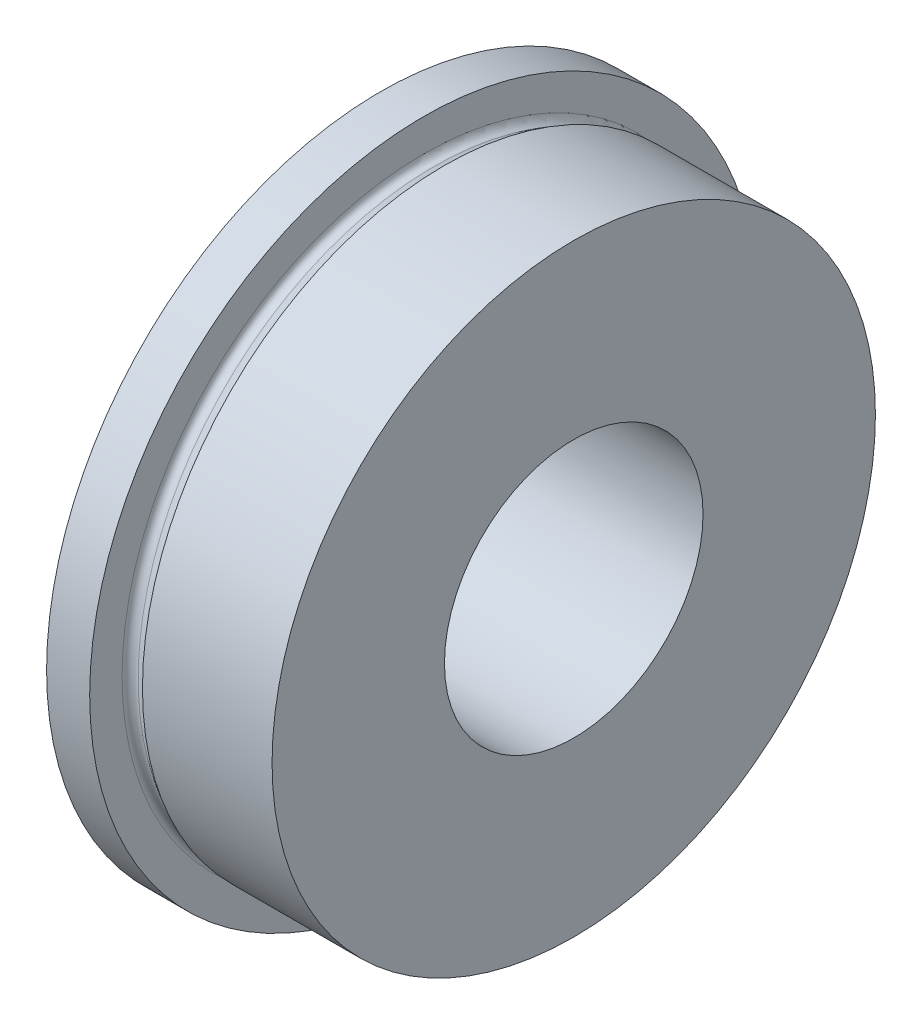
ISO-10303-21;
HEADER;
FILE_DESCRIPTION(('STEP AP214'),'2;1');
FILE_NAME('part.step','',(''),(''),'','','');
FILE_SCHEMA(('AUTOMOTIVE_DESIGN { 1 0 10303 214 1 1 1 1 }'));
ENDSEC;
DATA;
#1=APPLICATION_CONTEXT('core data for automotive mechanical design processes');
#2=APPLICATION_PROTOCOL_DEFINITION('international standard','automotive_design',2000,#1);
#3=PRODUCT_CONTEXT('',#1,'mechanical');
#4=PRODUCT('Part','Part','',(#3));
#5=PRODUCT_RELATED_PRODUCT_CATEGORY('part','',(#4));
#6=PRODUCT_DEFINITION_FORMATION('','',#4);
#7=PRODUCT_DEFINITION_CONTEXT('part definition',#1,'design');
#8=PRODUCT_DEFINITION('design','',#6,#7);
#9=PRODUCT_DEFINITION_SHAPE('','',#8);
#10=(LENGTH_UNIT() NAMED_UNIT(*) SI_UNIT(.MILLI.,.METRE.));
#11=(NAMED_UNIT(*) PLANE_ANGLE_UNIT() SI_UNIT($,.RADIAN.));
#12=(NAMED_UNIT(*) SI_UNIT($,.STERADIAN.) SOLID_ANGLE_UNIT());
#13=UNCERTAINTY_MEASURE_WITH_UNIT(LENGTH_MEASURE(1.E-05),#10,'distance_accuracy_value','');
#14=(GEOMETRIC_REPRESENTATION_CONTEXT(3) GLOBAL_UNCERTAINTY_ASSIGNED_CONTEXT((#13)) GLOBAL_UNIT_ASSIGNED_CONTEXT((#10,
#11,#12)) REPRESENTATION_CONTEXT('',''));
#15=CARTESIAN_POINT('',(0.,0.,0.));
#16=DIRECTION('',(0.,0.,1.));
#17=DIRECTION('',(1.,0.,0.));
#18=AXIS2_PLACEMENT_3D('',#15,#16,#17);
#19=CARTESIAN_POINT('',(0.,0.,0.));
#20=DIRECTION('',(-1.,0.,0.));
#21=DIRECTION('',(0.,0.,1.));
#22=AXIS2_PLACEMENT_3D('',#19,#20,#21);
#23=CYLINDRICAL_SURFACE('',#22,12.3063);
#24=CARTESIAN_POINT('',(0.,0.,0.));
#25=DIRECTION('',(-1.,0.,0.));
#26=DIRECTION('',(0.,0.,1.));
#27=AXIS2_PLACEMENT_3D('',#24,#25,#26);
#28=CIRCLE('',#27,12.3063);
#29=CARTESIAN_POINT('',(0.,0.,12.3063));
#30=VERTEX_POINT('',#29);
#31=EDGE_CURVE('E96',#30,#30,#28,.F.);
#32=ORIENTED_EDGE('',*,*,#31,.T.);
#33=EDGE_LOOP('',(#32));
#34=FACE_BOUND('',#33,.T.);
#35=CARTESIAN_POINT('',(1.58750000037,0.,0.));
#36=DIRECTION('',(-1.,0.,0.));
#37=DIRECTION('',(0.,0.,1.));
#38=AXIS2_PLACEMENT_3D('',#35,#36,#37);
#39=CIRCLE('',#38,12.3063);
#40=CARTESIAN_POINT('',(1.58750000037,0.,12.3063));
#41=VERTEX_POINT('',#40);
#42=EDGE_CURVE('E94',#41,#41,#39,.T.);
#43=ORIENTED_EDGE('',*,*,#42,.T.);
#44=EDGE_LOOP('',(#43));
#45=FACE_BOUND('',#44,.T.);
#46=ADVANCED_FACE('F17',(#34,#45),#23,.T.);
#47=CARTESIAN_POINT('',(0.,12.3063,0.));
#48=DIRECTION('',(1.,0.,0.));
#49=DIRECTION('',(0.,0.,-1.));
#50=AXIS2_PLACEMENT_3D('',#47,#48,#49);
#51=PLANE('',#50);
#52=CARTESIAN_POINT('',(0.,0.,0.));
#53=DIRECTION('',(-1.,0.,0.));
#54=DIRECTION('',(0.,0.,1.));
#55=AXIS2_PLACEMENT_3D('',#52,#53,#54);
#56=CIRCLE('',#55,9.906);
#57=CARTESIAN_POINT('',(0.,0.,9.906));
#58=VERTEX_POINT('',#57);
#59=EDGE_CURVE('E48',#58,#58,#56,.F.);
#60=ORIENTED_EDGE('',*,*,#59,.T.);
#61=EDGE_LOOP('',(#60));
#62=FACE_BOUND('',#61,.T.);
#63=ORIENTED_EDGE('',*,*,#31,.F.);
#64=EDGE_LOOP('',(#63));
#65=FACE_BOUND('',#64,.T.);
#66=ADVANCED_FACE('F66',(#62,#65),#51,.F.);
#67=CARTESIAN_POINT('',(1.5875,11.1125,0.));
#68=DIRECTION('',(-1.,0.,0.));
#69=DIRECTION('',(0.,0.,1.));
#70=AXIS2_PLACEMENT_3D('',#67,#68,#69);
#71=PLANE('',#70);
#72=CARTESIAN_POINT('',(1.5875,0.,0.));
#73=DIRECTION('',(1.,0.,0.));
#74=DIRECTION('',(0.,0.,1.));
#75=AXIS2_PLACEMENT_3D('',#72,#73,#74);
#76=CIRCLE('',#75,11.1125);
#77=CARTESIAN_POINT('',(1.5875,0.,-11.1125));
#78=VERTEX_POINT('',#77);
#79=CARTESIAN_POINT('',(1.5875,0.,11.1125));
#80=VERTEX_POINT('',#79);
#81=EDGE_CURVE('E34',#78,#80,#76,.F.);
#82=ORIENTED_EDGE('',*,*,#81,.T.);
#83=CARTESIAN_POINT('',(1.5875,0.,0.));
#84=DIRECTION('',(1.,0.,0.));
#85=DIRECTION('',(0.,0.,-1.));
#86=AXIS2_PLACEMENT_3D('',#83,#84,#85);
#87=CIRCLE('',#86,11.1125);
#88=EDGE_CURVE('E36',#80,#78,#87,.F.);
#89=ORIENTED_EDGE('',*,*,#88,.T.);
#90=EDGE_LOOP('',(#82,#89));
#91=FACE_BOUND('',#90,.T.);
#92=ORIENTED_EDGE('',*,*,#42,.F.);
#93=EDGE_LOOP('',(#92));
#94=FACE_BOUND('',#93,.T.);
#95=ADVANCED_FACE('F46',(#91,#94),#71,.F.);
#96=CARTESIAN_POINT('',(0.,0.,0.));
#97=DIRECTION('',(-1.,0.,0.));
#98=DIRECTION('',(0.,0.,1.));
#99=AXIS2_PLACEMENT_3D('',#96,#97,#98);
#100=CYLINDRICAL_SURFACE('',#99,9.906);
#101=CARTESIAN_POINT('',(0.380999999121,0.,0.));
#102=DIRECTION('',(-1.,0.,0.));
#103=DIRECTION('',(0.,0.,1.));
#104=AXIS2_PLACEMENT_3D('',#101,#102,#103);
#105=CIRCLE('',#104,9.906);
#106=CARTESIAN_POINT('',(0.380999999121,0.,9.906));
#107=VERTEX_POINT('',#106);
#108=EDGE_CURVE('E42',#107,#107,#105,.F.);
#109=ORIENTED_EDGE('',*,*,#108,.T.);
#110=EDGE_LOOP('',(#109));
#111=FACE_BOUND('',#110,.T.);
#112=ORIENTED_EDGE('',*,*,#59,.F.);
#113=EDGE_LOOP('',(#112));
#114=FACE_BOUND('',#113,.T.);
#115=ADVANCED_FACE('F65',(#111,#114),#100,.F.);
#116=CARTESIAN_POINT('',(0.381,9.906,0.));
#117=DIRECTION('',(1.,0.,0.));
#118=DIRECTION('',(0.,0.,-1.));
#119=AXIS2_PLACEMENT_3D('',#116,#117,#118);
#120=PLANE('',#119);
#121=CARTESIAN_POINT('',(0.380999999121,0.,0.));
#122=DIRECTION('',(-1.,0.,0.));
#123=DIRECTION('',(0.,0.,1.));
#124=AXIS2_PLACEMENT_3D('',#121,#122,#123);
#125=CIRCLE('',#124,6.35);
#126=CARTESIAN_POINT('',(0.380999999121,0.,6.35));
#127=VERTEX_POINT('',#126);
#128=EDGE_CURVE('E87',#127,#127,#125,.T.);
#129=ORIENTED_EDGE('',*,*,#128,.F.);
#130=EDGE_LOOP('',(#129));
#131=FACE_BOUND('',#130,.T.);
#132=ORIENTED_EDGE('',*,*,#108,.F.);
#133=EDGE_LOOP('',(#132));
#134=FACE_BOUND('',#133,.T.);
#135=ADVANCED_FACE('F138',(#131,#134),#120,.F.);
#136=CARTESIAN_POINT('',(1.8375,0.,0.));
#137=DIRECTION('',(-1.,0.,0.));
#138=DIRECTION('',(0.,0.,1.));
#139=AXIS2_PLACEMENT_3D('',#136,#137,#138);
#140=TOROIDAL_SURFACE('',#139,11.1125,0.25);
#141=ORIENTED_EDGE('',*,*,#88,.F.);
#142=ORIENTED_EDGE('',*,*,#81,.F.);
#143=EDGE_LOOP('',(#141,#142));
#144=FACE_BOUND('',#143,.T.);
#145=CARTESIAN_POINT('',(1.9625000000199,0.,0.));
#146=DIRECTION('',(1.,0.,0.));
#147=DIRECTION('',(0.,0.,-1.));
#148=AXIS2_PLACEMENT_3D('',#145,#146,#147);
#149=CIRCLE('',#148,10.8959936490655);
#150=CARTESIAN_POINT('',(1.9625000000199,0.,-10.8959936490655));
#151=VERTEX_POINT('',#150);
#152=EDGE_CURVE('E86',#151,#151,#149,.T.);
#153=ORIENTED_EDGE('',*,*,#152,.F.);
#154=EDGE_LOOP('',(#153));
#155=FACE_BOUND('',#154,.T.);
#156=ADVANCED_FACE('F38',(#144,#155),#140,.F.);
#157=CARTESIAN_POINT('',(0.,0.,0.));
#158=DIRECTION('',(-1.,0.,0.));
#159=DIRECTION('',(0.,0.,1.));
#160=AXIS2_PLACEMENT_3D('',#157,#158,#159);
#161=CYLINDRICAL_SURFACE('',#160,6.35);
#162=CARTESIAN_POINT('',(0.,0.,0.));
#163=DIRECTION('',(-1.,0.,0.));
#164=DIRECTION('',(0.,0.,1.));
#165=AXIS2_PLACEMENT_3D('',#162,#163,#164);
#166=CIRCLE('',#165,6.35);
#167=CARTESIAN_POINT('',(0.,0.,6.35));
#168=VERTEX_POINT('',#167);
#169=EDGE_CURVE('E83',#168,#168,#166,.F.);
#170=ORIENTED_EDGE('',*,*,#169,.T.);
#171=EDGE_LOOP('',(#170));
#172=FACE_BOUND('',#171,.T.);
#173=ORIENTED_EDGE('',*,*,#128,.T.);
#174=EDGE_LOOP('',(#173));
#175=FACE_BOUND('',#174,.T.);
#176=ADVANCED_FACE('F132',(#172,#175),#161,.T.);
#177=CARTESIAN_POINT('',(2.3375,0.,0.));
#178=DIRECTION('',(1.,0.,0.));
#179=DIRECTION('',(0.,0.,-1.));
#180=AXIS2_PLACEMENT_3D('',#177,#178,#179);
#181=CONICAL_SURFACE('',#180,11.1125,0.523598775597999);
#182=CARTESIAN_POINT('',(2.3375,0.,0.));
#183=DIRECTION('',(-1.,0.,0.));
#184=DIRECTION('',(0.,0.,1.));
#185=AXIS2_PLACEMENT_3D('',#182,#183,#184);
#186=CIRCLE('',#185,11.1125);
#187=CARTESIAN_POINT('',(2.3375,0.,11.1125));
#188=VERTEX_POINT('',#187);
#189=EDGE_CURVE('E82',#188,#188,#186,.F.);
#190=ORIENTED_EDGE('',*,*,#189,.F.);
#191=EDGE_LOOP('',(#190));
#192=FACE_BOUND('',#191,.T.);
#193=ORIENTED_EDGE('',*,*,#152,.T.);
#194=EDGE_LOOP('',(#193));
#195=FACE_BOUND('',#194,.T.);
#196=ADVANCED_FACE('F128',(#192,#195),#181,.T.);
#197=CARTESIAN_POINT('',(0.,6.35,0.));
#198=DIRECTION('',(1.,0.,0.));
#199=DIRECTION('',(0.,0.,-1.));
#200=AXIS2_PLACEMENT_3D('',#197,#198,#199);
#201=PLANE('',#200);
#202=CARTESIAN_POINT('',(0.,0.,0.));
#203=DIRECTION('',(-1.,0.,0.));
#204=DIRECTION('',(0.,0.,1.));
#205=AXIS2_PLACEMENT_3D('',#202,#203,#204);
#206=CIRCLE('',#205,4.7625);
#207=CARTESIAN_POINT('',(0.,0.,4.7625));
#208=VERTEX_POINT('',#207);
#209=EDGE_CURVE('E79',#208,#208,#206,.F.);
#210=ORIENTED_EDGE('',*,*,#209,.T.);
#211=EDGE_LOOP('',(#210));
#212=FACE_BOUND('',#211,.T.);
#213=ORIENTED_EDGE('',*,*,#169,.F.);
#214=EDGE_LOOP('',(#213));
#215=FACE_BOUND('',#214,.T.);
#216=ADVANCED_FACE('F124',(#212,#215),#201,.F.);
#217=CARTESIAN_POINT('',(0.,0.,0.));
#218=DIRECTION('',(-1.,0.,0.));
#219=DIRECTION('',(0.,0.,1.));
#220=AXIS2_PLACEMENT_3D('',#217,#218,#219);
#221=CYLINDRICAL_SURFACE('',#220,11.1125);
#222=ORIENTED_EDGE('',*,*,#189,.T.);
#223=EDGE_LOOP('',(#222));
#224=FACE_BOUND('',#223,.T.);
#225=CARTESIAN_POINT('',(7.11199999973,0.,0.));
#226=DIRECTION('',(-1.,0.,0.));
#227=DIRECTION('',(0.,0.,1.));
#228=AXIS2_PLACEMENT_3D('',#225,#226,#227);
#229=CIRCLE('',#228,11.1125);
#230=CARTESIAN_POINT('',(7.11199999973,0.,11.1125));
#231=VERTEX_POINT('',#230);
#232=EDGE_CURVE('E27',#231,#231,#229,.T.);
#233=ORIENTED_EDGE('',*,*,#232,.T.);
#234=EDGE_LOOP('',(#233));
#235=FACE_BOUND('',#234,.T.);
#236=ADVANCED_FACE('F116',(#224,#235),#221,.T.);
#237=CARTESIAN_POINT('',(0.,0.,0.));
#238=DIRECTION('',(-1.,0.,0.));
#239=DIRECTION('',(0.,0.,1.));
#240=AXIS2_PLACEMENT_3D('',#237,#238,#239);
#241=CYLINDRICAL_SURFACE('',#240,4.7625);
#242=CARTESIAN_POINT('',(7.11199999973,0.,0.));
#243=DIRECTION('',(-1.,0.,0.));
#244=DIRECTION('',(0.,0.,1.));
#245=AXIS2_PLACEMENT_3D('',#242,#243,#244);
#246=CIRCLE('',#245,4.7625);
#247=CARTESIAN_POINT('',(7.11199999973,0.,4.7625));
#248=VERTEX_POINT('',#247);
#249=EDGE_CURVE('E11',#248,#248,#246,.F.);
#250=ORIENTED_EDGE('',*,*,#249,.T.);
#251=EDGE_LOOP('',(#250));
#252=FACE_BOUND('',#251,.T.);
#253=ORIENTED_EDGE('',*,*,#209,.F.);
#254=EDGE_LOOP('',(#253));
#255=FACE_BOUND('',#254,.T.);
#256=ADVANCED_FACE('F110',(#252,#255),#241,.F.);
#257=CARTESIAN_POINT('',(7.112,4.7625,0.));
#258=DIRECTION('',(-1.,0.,0.));
#259=DIRECTION('',(0.,0.,1.));
#260=AXIS2_PLACEMENT_3D('',#257,#258,#259);
#261=PLANE('',#260);
#262=ORIENTED_EDGE('',*,*,#249,.F.);
#263=EDGE_LOOP('',(#262));
#264=FACE_BOUND('',#263,.T.);
#265=ORIENTED_EDGE('',*,*,#232,.F.);
#266=EDGE_LOOP('',(#265));
#267=FACE_BOUND('',#266,.T.);
#268=ADVANCED_FACE('F108',(#264,#267),#261,.F.);
#269=CLOSED_SHELL('',(#46,#66,#95,#115,#135,#156,#176,#196,#216,#236,#256,#268));
#270=MANIFOLD_SOLID_BREP('B1',#269);
#271=ADVANCED_BREP_SHAPE_REPRESENTATION('',(#18,#270),#14);
#272=SHAPE_DEFINITION_REPRESENTATION(#9,#271);
ENDSEC;
END-ISO-10303-21;
